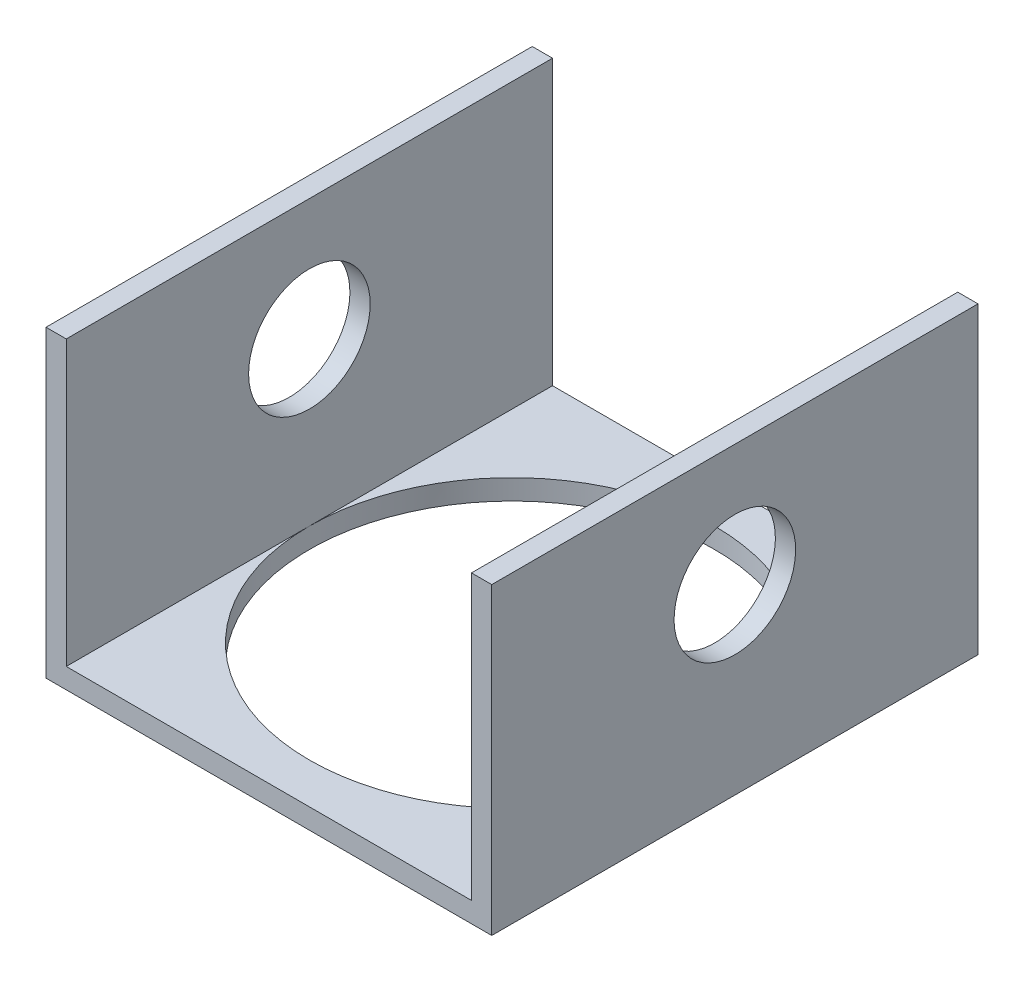
ISO-10303-21;
HEADER;
FILE_DESCRIPTION(('STEP AP214'),'2;1');
FILE_NAME('part.step','',(''),(''),'','','');
FILE_SCHEMA(('AUTOMOTIVE_DESIGN { 1 0 10303 214 1 1 1 1 }'));
ENDSEC;
DATA;
#1=APPLICATION_CONTEXT('core data for automotive mechanical design processes');
#2=APPLICATION_PROTOCOL_DEFINITION('international standard','automotive_design',2000,#1);
#3=PRODUCT_CONTEXT('',#1,'mechanical');
#4=PRODUCT('Part','Part','',(#3));
#5=PRODUCT_RELATED_PRODUCT_CATEGORY('part','',(#4));
#6=PRODUCT_DEFINITION_FORMATION('','',#4);
#7=PRODUCT_DEFINITION_CONTEXT('part definition',#1,'design');
#8=PRODUCT_DEFINITION('design','',#6,#7);
#9=PRODUCT_DEFINITION_SHAPE('','',#8);
#10=(LENGTH_UNIT() NAMED_UNIT(*) SI_UNIT(.MILLI.,.METRE.));
#11=(NAMED_UNIT(*) PLANE_ANGLE_UNIT() SI_UNIT($,.RADIAN.));
#12=(NAMED_UNIT(*) SI_UNIT($,.STERADIAN.) SOLID_ANGLE_UNIT());
#13=UNCERTAINTY_MEASURE_WITH_UNIT(LENGTH_MEASURE(1.E-05),#10,'distance_accuracy_value','');
#14=(GEOMETRIC_REPRESENTATION_CONTEXT(3) GLOBAL_UNCERTAINTY_ASSIGNED_CONTEXT((#13)) GLOBAL_UNIT_ASSIGNED_CONTEXT((#10,
#11,#12)) REPRESENTATION_CONTEXT('',''));
#15=CARTESIAN_POINT('',(0.,0.,0.));
#16=DIRECTION('',(0.,0.,1.));
#17=DIRECTION('',(1.,0.,0.));
#18=AXIS2_PLACEMENT_3D('',#15,#16,#17);
#19=CARTESIAN_POINT('',(-31.75,0.,38.1));
#20=DIRECTION('',(0.,-1.,0.));
#21=DIRECTION('',(1.,0.,0.));
#22=AXIS2_PLACEMENT_3D('',#19,#20,#21);
#23=PLANE('',#22);
#24=DIRECTION('',(0.,0.,-1.));
#25=VECTOR('',#24,1.);
#26=CARTESIAN_POINT('',(31.75,0.,38.1));
#27=LINE('',#26,#25);
#28=CARTESIAN_POINT('',(31.75,0.,38.1));
#29=VERTEX_POINT('',#28);
#30=CARTESIAN_POINT('',(31.75,0.,0.));
#31=VERTEX_POINT('',#30);
#32=EDGE_CURVE('E41',#29,#31,#27,.T.);
#33=ORIENTED_EDGE('',*,*,#32,.T.);
#34=CARTESIAN_POINT('',(0.,0.,0.));
#35=DIRECTION('',(0.,-1.,0.));
#36=DIRECTION('',(1.,0.,0.));
#37=AXIS2_PLACEMENT_3D('',#34,#35,#36);
#38=CIRCLE('',#37,31.75);
#39=CARTESIAN_POINT('',(-31.75,0.,0.));
#40=VERTEX_POINT('',#39);
#41=EDGE_CURVE('E47',#31,#40,#38,.T.);
#42=ORIENTED_EDGE('',*,*,#41,.T.);
#43=DIRECTION('',(0.,0.,-1.));
#44=VECTOR('',#43,1.);
#45=CARTESIAN_POINT('',(-31.75,0.,38.1));
#46=LINE('',#45,#44);
#47=CARTESIAN_POINT('',(-31.75,0.,38.1));
#48=VERTEX_POINT('',#47);
#49=EDGE_CURVE('E164',#48,#40,#46,.T.);
#50=ORIENTED_EDGE('',*,*,#49,.F.);
#51=DIRECTION('',(-1.,0.,0.));
#52=VECTOR('',#51,1.);
#53=CARTESIAN_POINT('',(-31.75,0.,38.1));
#54=LINE('',#53,#52);
#55=EDGE_CURVE('E207',#29,#48,#54,.T.);
#56=ORIENTED_EDGE('',*,*,#55,.F.);
#57=EDGE_LOOP('',(#33,#42,#50,#56));
#58=FACE_BOUND('',#57,.T.);
#59=ADVANCED_FACE('F33',(#58),#23,.F.);
#60=CARTESIAN_POINT('',(31.75,44.45,38.1));
#61=DIRECTION('',(0.,-1.,0.));
#62=DIRECTION('',(1.,0.,0.));
#63=AXIS2_PLACEMENT_3D('',#60,#61,#62);
#64=PLANE('',#63);
#65=DIRECTION('',(-1.,0.,0.));
#66=VECTOR('',#65,1.);
#67=CARTESIAN_POINT('',(31.75,44.45,-38.1));
#68=LINE('',#67,#66);
#69=CARTESIAN_POINT('',(34.925,44.45,-38.1));
#70=VERTEX_POINT('',#69);
#71=CARTESIAN_POINT('',(31.75,44.45,-38.1));
#72=VERTEX_POINT('',#71);
#73=EDGE_CURVE('E138',#70,#72,#68,.T.);
#74=ORIENTED_EDGE('',*,*,#73,.T.);
#75=DIRECTION('',(0.,0.,-1.));
#76=VECTOR('',#75,1.);
#77=CARTESIAN_POINT('',(31.75,44.45,38.1));
#78=LINE('',#77,#76);
#79=CARTESIAN_POINT('',(31.75,44.45,38.1));
#80=VERTEX_POINT('',#79);
#81=EDGE_CURVE('E11',#80,#72,#78,.T.);
#82=ORIENTED_EDGE('',*,*,#81,.F.);
#83=DIRECTION('',(-1.,0.,0.));
#84=VECTOR('',#83,1.);
#85=CARTESIAN_POINT('',(31.75,44.45,38.1));
#86=LINE('',#85,#84);
#87=CARTESIAN_POINT('',(34.925,44.45,38.1));
#88=VERTEX_POINT('',#87);
#89=EDGE_CURVE('E157',#88,#80,#86,.T.);
#90=ORIENTED_EDGE('',*,*,#89,.F.);
#91=DIRECTION('',(0.,0.,-1.));
#92=VECTOR('',#91,1.);
#93=CARTESIAN_POINT('',(34.925,44.45,38.1));
#94=LINE('',#93,#92);
#95=EDGE_CURVE('E134',#88,#70,#94,.T.);
#96=ORIENTED_EDGE('',*,*,#95,.T.);
#97=EDGE_LOOP('',(#74,#82,#90,#96));
#98=FACE_BOUND('',#97,.T.);
#99=ADVANCED_FACE('F35',(#98),#64,.F.);
#100=CARTESIAN_POINT('',(31.75,0.,38.1));
#101=DIRECTION('',(1.,0.,0.));
#102=DIRECTION('',(0.,1.,0.));
#103=AXIS2_PLACEMENT_3D('',#100,#101,#102);
#104=PLANE('',#103);
#105=CARTESIAN_POINT('',(31.75,25.4,0.));
#106=DIRECTION('',(1.,0.,0.));
#107=DIRECTION('',(0.,1.,0.));
#108=AXIS2_PLACEMENT_3D('',#105,#106,#107);
#109=CIRCLE('',#108,9.525);
#110=CARTESIAN_POINT('',(31.75,34.925,0.));
#111=VERTEX_POINT('',#110);
#112=EDGE_CURVE('E142',#111,#111,#109,.T.);
#113=ORIENTED_EDGE('',*,*,#112,.T.);
#114=EDGE_LOOP('',(#113));
#115=FACE_BOUND('',#114,.T.);
#116=ORIENTED_EDGE('',*,*,#81,.T.);
#117=DIRECTION('',(0.,-1.,0.));
#118=VECTOR('',#117,1.);
#119=CARTESIAN_POINT('',(31.75,0.,-38.1));
#120=LINE('',#119,#118);
#121=CARTESIAN_POINT('',(31.75,0.,-38.1));
#122=VERTEX_POINT('',#121);
#123=EDGE_CURVE('E141',#72,#122,#120,.T.);
#124=ORIENTED_EDGE('',*,*,#123,.T.);
#125=EDGE_CURVE('E166',#31,#122,#27,.T.);
#126=ORIENTED_EDGE('',*,*,#125,.F.);
#127=ORIENTED_EDGE('',*,*,#32,.F.);
#128=DIRECTION('',(0.,-1.,0.));
#129=VECTOR('',#128,1.);
#130=CARTESIAN_POINT('',(31.75,0.,38.1));
#131=LINE('',#130,#129);
#132=EDGE_CURVE('E96',#80,#29,#131,.T.);
#133=ORIENTED_EDGE('',*,*,#132,.F.);
#134=EDGE_LOOP('',(#116,#124,#126,#127,#133));
#135=FACE_BOUND('',#134,.T.);
#136=ADVANCED_FACE('F178',(#115,#135),#104,.F.);
#137=CARTESIAN_POINT('',(-31.75,0.,-38.1));
#138=VERTEX_POINT('',#137);
#139=EDGE_CURVE('E163',#40,#138,#46,.T.);
#140=ORIENTED_EDGE('',*,*,#139,.F.);
#141=EDGE_CURVE('E176',#40,#31,#38,.T.);
#142=ORIENTED_EDGE('',*,*,#141,.T.);
#143=ORIENTED_EDGE('',*,*,#125,.T.);
#144=DIRECTION('',(-1.,0.,0.));
#145=VECTOR('',#144,1.);
#146=CARTESIAN_POINT('',(-31.75,0.,-38.1));
#147=LINE('',#146,#145);
#148=EDGE_CURVE('E145',#122,#138,#147,.T.);
#149=ORIENTED_EDGE('',*,*,#148,.T.);
#150=EDGE_LOOP('',(#140,#142,#143,#149));
#151=FACE_BOUND('',#150,.T.);
#152=ADVANCED_FACE('F173',(#151),#23,.F.);
#153=CARTESIAN_POINT('',(-31.75,44.45,38.1));
#154=DIRECTION('',(-1.,0.,0.));
#155=DIRECTION('',(0.,-1.,0.));
#156=AXIS2_PLACEMENT_3D('',#153,#154,#155);
#157=PLANE('',#156);
#158=CARTESIAN_POINT('',(-31.75,25.4,0.));
#159=DIRECTION('',(-1.,0.,0.));
#160=DIRECTION('',(0.,-1.,0.));
#161=AXIS2_PLACEMENT_3D('',#158,#159,#160);
#162=CIRCLE('',#161,9.525);
#163=CARTESIAN_POINT('',(-31.75,15.875,0.));
#164=VERTEX_POINT('',#163);
#165=EDGE_CURVE('E199',#164,#164,#162,.T.);
#166=ORIENTED_EDGE('',*,*,#165,.T.);
#167=EDGE_LOOP('',(#166));
#168=FACE_BOUND('',#167,.T.);
#169=DIRECTION('',(0.,1.,0.));
#170=VECTOR('',#169,1.);
#171=CARTESIAN_POINT('',(-31.75,44.45,-38.1));
#172=LINE('',#171,#170);
#173=CARTESIAN_POINT('',(-31.75,44.45,-38.1));
#174=VERTEX_POINT('',#173);
#175=EDGE_CURVE('E148',#138,#174,#172,.T.);
#176=ORIENTED_EDGE('',*,*,#175,.T.);
#177=DIRECTION('',(0.,0.,-1.));
#178=VECTOR('',#177,1.);
#179=CARTESIAN_POINT('',(-31.75,44.45,38.1));
#180=LINE('',#179,#178);
#181=CARTESIAN_POINT('',(-31.75,44.45,38.1));
#182=VERTEX_POINT('',#181);
#183=EDGE_CURVE('E161',#182,#174,#180,.T.);
#184=ORIENTED_EDGE('',*,*,#183,.F.);
#185=DIRECTION('',(0.,1.,0.));
#186=VECTOR('',#185,1.);
#187=CARTESIAN_POINT('',(-31.75,44.45,38.1));
#188=LINE('',#187,#186);
#189=EDGE_CURVE('E209',#48,#182,#188,.T.);
#190=ORIENTED_EDGE('',*,*,#189,.F.);
#191=ORIENTED_EDGE('',*,*,#49,.T.);
#192=ORIENTED_EDGE('',*,*,#139,.T.);
#193=EDGE_LOOP('',(#176,#184,#190,#191,#192));
#194=FACE_BOUND('',#193,.T.);
#195=ADVANCED_FACE('F186',(#168,#194),#157,.F.);
#196=CARTESIAN_POINT('',(-34.925,44.45,38.1));
#197=DIRECTION('',(0.,-1.,0.));
#198=DIRECTION('',(1.,0.,0.));
#199=AXIS2_PLACEMENT_3D('',#196,#197,#198);
#200=PLANE('',#199);
#201=DIRECTION('',(-1.,0.,0.));
#202=VECTOR('',#201,1.);
#203=CARTESIAN_POINT('',(-34.925,44.45,-38.1));
#204=LINE('',#203,#202);
#205=CARTESIAN_POINT('',(-34.925,44.45,-38.1));
#206=VERTEX_POINT('',#205);
#207=EDGE_CURVE('E151',#174,#206,#204,.T.);
#208=ORIENTED_EDGE('',*,*,#207,.T.);
#209=DIRECTION('',(0.,0.,-1.));
#210=VECTOR('',#209,1.);
#211=CARTESIAN_POINT('',(-34.925,44.45,38.1));
#212=LINE('',#211,#210);
#213=CARTESIAN_POINT('',(-34.925,44.45,38.1));
#214=VERTEX_POINT('',#213);
#215=EDGE_CURVE('E129',#214,#206,#212,.T.);
#216=ORIENTED_EDGE('',*,*,#215,.F.);
#217=DIRECTION('',(-1.,0.,0.));
#218=VECTOR('',#217,1.);
#219=CARTESIAN_POINT('',(-34.925,44.45,38.1));
#220=LINE('',#219,#218);
#221=EDGE_CURVE('E117',#182,#214,#220,.T.);
#222=ORIENTED_EDGE('',*,*,#221,.F.);
#223=ORIENTED_EDGE('',*,*,#183,.T.);
#224=EDGE_LOOP('',(#208,#216,#222,#223));
#225=FACE_BOUND('',#224,.T.);
#226=ADVANCED_FACE('F236',(#225),#200,.F.);
#227=CARTESIAN_POINT('',(-34.925,-3.175,38.1));
#228=DIRECTION('',(1.,0.,0.));
#229=DIRECTION('',(0.,0.,-1.));
#230=AXIS2_PLACEMENT_3D('',#227,#228,#229);
#231=PLANE('',#230);
#232=CARTESIAN_POINT('',(-34.925,25.4,0.));
#233=DIRECTION('',(1.,0.,0.));
#234=DIRECTION('',(0.,1.,0.));
#235=AXIS2_PLACEMENT_3D('',#232,#233,#234);
#236=CIRCLE('',#235,9.525);
#237=CARTESIAN_POINT('',(-34.925,34.925,0.));
#238=VERTEX_POINT('',#237);
#239=EDGE_CURVE('E194',#238,#238,#236,.T.);
#240=ORIENTED_EDGE('',*,*,#239,.T.);
#241=EDGE_LOOP('',(#240));
#242=FACE_BOUND('',#241,.T.);
#243=DIRECTION('',(0.,-1.,0.));
#244=VECTOR('',#243,1.);
#245=CARTESIAN_POINT('',(-34.925,-3.175,-38.1));
#246=LINE('',#245,#244);
#247=CARTESIAN_POINT('',(-34.925,-3.175,-38.1));
#248=VERTEX_POINT('',#247);
#249=EDGE_CURVE('E126',#206,#248,#246,.T.);
#250=ORIENTED_EDGE('',*,*,#249,.T.);
#251=DIRECTION('',(0.,0.,-1.));
#252=VECTOR('',#251,1.);
#253=CARTESIAN_POINT('',(-34.925,-3.175,38.1));
#254=LINE('',#253,#252);
#255=CARTESIAN_POINT('',(-34.925,-3.175,38.1));
#256=VERTEX_POINT('',#255);
#257=EDGE_CURVE('E123',#256,#248,#254,.T.);
#258=ORIENTED_EDGE('',*,*,#257,.F.);
#259=DIRECTION('',(0.,-1.,0.));
#260=VECTOR('',#259,1.);
#261=CARTESIAN_POINT('',(-34.925,-3.175,38.1));
#262=LINE('',#261,#260);
#263=EDGE_CURVE('E110',#214,#256,#262,.T.);
#264=ORIENTED_EDGE('',*,*,#263,.F.);
#265=ORIENTED_EDGE('',*,*,#215,.T.);
#266=EDGE_LOOP('',(#250,#258,#264,#265));
#267=FACE_BOUND('',#266,.T.);
#268=ADVANCED_FACE('F124',(#242,#267),#231,.F.);
#269=CARTESIAN_POINT('',(34.925,-3.17499999999999,38.1));
#270=DIRECTION('',(0.,1.,0.));
#271=DIRECTION('',(-1.,0.,0.));
#272=AXIS2_PLACEMENT_3D('',#269,#270,#271);
#273=PLANE('',#272);
#274=CARTESIAN_POINT('',(0.,-3.175,0.));
#275=DIRECTION('',(0.,-1.,0.));
#276=DIRECTION('',(1.,0.,0.));
#277=AXIS2_PLACEMENT_3D('',#274,#275,#276);
#278=CIRCLE('',#277,31.75);
#279=CARTESIAN_POINT('',(31.75,-3.17499999999999,0.));
#280=VERTEX_POINT('',#279);
#281=EDGE_CURVE('E190',#280,#280,#278,.T.);
#282=ORIENTED_EDGE('',*,*,#281,.F.);
#283=EDGE_LOOP('',(#282));
#284=FACE_BOUND('',#283,.T.);
#285=DIRECTION('',(1.,0.,0.));
#286=VECTOR('',#285,1.);
#287=CARTESIAN_POINT('',(34.925,-3.17499999999999,-38.1));
#288=LINE('',#287,#286);
#289=CARTESIAN_POINT('',(34.925,-3.17499999999999,-38.1));
#290=VERTEX_POINT('',#289);
#291=EDGE_CURVE('E154',#248,#290,#288,.T.);
#292=ORIENTED_EDGE('',*,*,#291,.T.);
#293=DIRECTION('',(0.,0.,-1.));
#294=VECTOR('',#293,1.);
#295=CARTESIAN_POINT('',(34.925,-3.17499999999999,38.1));
#296=LINE('',#295,#294);
#297=CARTESIAN_POINT('',(34.925,-3.17499999999999,38.1));
#298=VERTEX_POINT('',#297);
#299=EDGE_CURVE('E130',#298,#290,#296,.T.);
#300=ORIENTED_EDGE('',*,*,#299,.F.);
#301=DIRECTION('',(1.,0.,0.));
#302=VECTOR('',#301,1.);
#303=CARTESIAN_POINT('',(34.925,-3.17499999999999,38.1));
#304=LINE('',#303,#302);
#305=EDGE_CURVE('E114',#256,#298,#304,.T.);
#306=ORIENTED_EDGE('',*,*,#305,.F.);
#307=ORIENTED_EDGE('',*,*,#257,.T.);
#308=EDGE_LOOP('',(#292,#300,#306,#307));
#309=FACE_BOUND('',#308,.T.);
#310=ADVANCED_FACE('F132',(#284,#309),#273,.F.);
#311=CARTESIAN_POINT('',(34.925,44.45,38.1));
#312=DIRECTION('',(-1.,0.,0.));
#313=DIRECTION('',(0.,-1.,0.));
#314=AXIS2_PLACEMENT_3D('',#311,#312,#313);
#315=PLANE('',#314);
#316=CARTESIAN_POINT('',(34.925,25.4,0.));
#317=DIRECTION('',(1.,0.,0.));
#318=DIRECTION('',(0.,1.,0.));
#319=AXIS2_PLACEMENT_3D('',#316,#317,#318);
#320=CIRCLE('',#319,9.525);
#321=CARTESIAN_POINT('',(34.925,34.925,0.));
#322=VERTEX_POINT('',#321);
#323=EDGE_CURVE('E192',#322,#322,#320,.T.);
#324=ORIENTED_EDGE('',*,*,#323,.F.);
#325=EDGE_LOOP('',(#324));
#326=FACE_BOUND('',#325,.T.);
#327=DIRECTION('',(0.,1.,0.));
#328=VECTOR('',#327,1.);
#329=CARTESIAN_POINT('',(34.925,44.45,-38.1));
#330=LINE('',#329,#328);
#331=EDGE_CURVE('E88',#290,#70,#330,.T.);
#332=ORIENTED_EDGE('',*,*,#331,.T.);
#333=ORIENTED_EDGE('',*,*,#95,.F.);
#334=DIRECTION('',(0.,1.,0.));
#335=VECTOR('',#334,1.);
#336=CARTESIAN_POINT('',(34.925,44.45,38.1));
#337=LINE('',#336,#335);
#338=EDGE_CURVE('E56',#298,#88,#337,.T.);
#339=ORIENTED_EDGE('',*,*,#338,.F.);
#340=ORIENTED_EDGE('',*,*,#299,.T.);
#341=EDGE_LOOP('',(#332,#333,#339,#340));
#342=FACE_BOUND('',#341,.T.);
#343=ADVANCED_FACE('F212',(#326,#342),#315,.F.);
#344=CARTESIAN_POINT('',(0.,0.,38.1));
#345=DIRECTION('',(0.,0.,-1.));
#346=DIRECTION('',(-1.,0.,0.));
#347=AXIS2_PLACEMENT_3D('',#344,#345,#346);
#348=PLANE('',#347);
#349=ORIENTED_EDGE('',*,*,#89,.T.);
#350=ORIENTED_EDGE('',*,*,#132,.T.);
#351=ORIENTED_EDGE('',*,*,#55,.T.);
#352=ORIENTED_EDGE('',*,*,#189,.T.);
#353=ORIENTED_EDGE('',*,*,#221,.T.);
#354=ORIENTED_EDGE('',*,*,#263,.T.);
#355=ORIENTED_EDGE('',*,*,#305,.T.);
#356=ORIENTED_EDGE('',*,*,#338,.T.);
#357=EDGE_LOOP('',(#349,#350,#351,#352,#353,#354,#355,#356));
#358=FACE_BOUND('',#357,.T.);
#359=ADVANCED_FACE('F112',(#358),#348,.F.);
#360=CARTESIAN_POINT('',(0.,0.,-38.1));
#361=DIRECTION('',(0.,0.,-1.));
#362=DIRECTION('',(-1.,0.,0.));
#363=AXIS2_PLACEMENT_3D('',#360,#361,#362);
#364=PLANE('',#363);
#365=ORIENTED_EDGE('',*,*,#73,.F.);
#366=ORIENTED_EDGE('',*,*,#331,.F.);
#367=ORIENTED_EDGE('',*,*,#291,.F.);
#368=ORIENTED_EDGE('',*,*,#249,.F.);
#369=ORIENTED_EDGE('',*,*,#207,.F.);
#370=ORIENTED_EDGE('',*,*,#175,.F.);
#371=ORIENTED_EDGE('',*,*,#148,.F.);
#372=ORIENTED_EDGE('',*,*,#123,.F.);
#373=EDGE_LOOP('',(#365,#366,#367,#368,#369,#370,#371,#372));
#374=FACE_BOUND('',#373,.T.);
#375=ADVANCED_FACE('F182',(#374),#364,.T.);
#376=CARTESIAN_POINT('',(-34.925,25.4,0.));
#377=DIRECTION('',(1.,0.,0.));
#378=DIRECTION('',(0.,1.,0.));
#379=AXIS2_PLACEMENT_3D('',#376,#377,#378);
#380=CYLINDRICAL_SURFACE('',#379,9.525);
#381=ORIENTED_EDGE('',*,*,#323,.T.);
#382=EDGE_LOOP('',(#381));
#383=FACE_BOUND('',#382,.T.);
#384=ORIENTED_EDGE('',*,*,#112,.F.);
#385=EDGE_LOOP('',(#384));
#386=FACE_BOUND('',#385,.T.);
#387=ADVANCED_FACE('F243',(#383,#386),#380,.F.);
#388=ORIENTED_EDGE('',*,*,#239,.F.);
#389=EDGE_LOOP('',(#388));
#390=FACE_BOUND('',#389,.T.);
#391=ORIENTED_EDGE('',*,*,#165,.F.);
#392=EDGE_LOOP('',(#391));
#393=FACE_BOUND('',#392,.T.);
#394=ADVANCED_FACE('F245',(#390,#393),#380,.F.);
#395=CARTESIAN_POINT('',(0.,44.45,0.));
#396=DIRECTION('',(0.,-1.,0.));
#397=DIRECTION('',(1.,0.,0.));
#398=AXIS2_PLACEMENT_3D('',#395,#396,#397);
#399=CYLINDRICAL_SURFACE('',#398,31.75);
#400=ORIENTED_EDGE('',*,*,#281,.T.);
#401=EDGE_LOOP('',(#400));
#402=FACE_BOUND('',#401,.T.);
#403=ORIENTED_EDGE('',*,*,#141,.F.);
#404=ORIENTED_EDGE('',*,*,#41,.F.);
#405=EDGE_LOOP('',(#403,#404));
#406=FACE_BOUND('',#405,.T.);
#407=ADVANCED_FACE('F189',(#402,#406),#399,.F.);
#408=CLOSED_SHELL('',(#59,#99,#136,#152,#195,#226,#268,#310,#343,#359,#375,#387,#394,#407));
#409=MANIFOLD_SOLID_BREP('B2',#408);
#410=ADVANCED_BREP_SHAPE_REPRESENTATION('',(#18,#409),#14);
#411=SHAPE_DEFINITION_REPRESENTATION(#9,#410);
ENDSEC;
END-ISO-10303-21;
